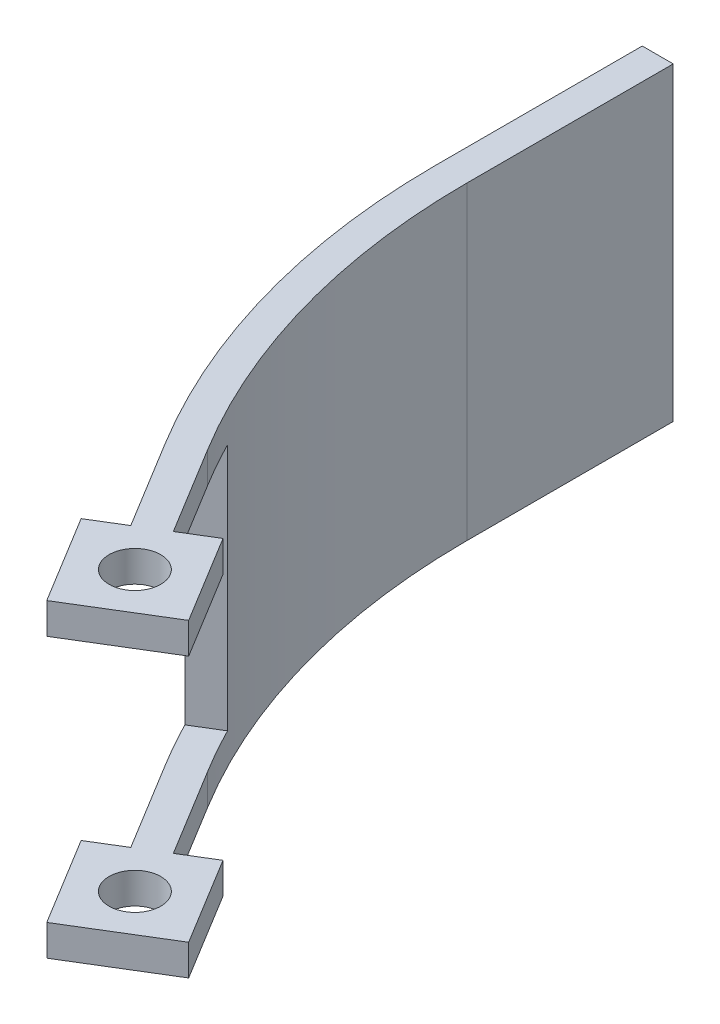
ISO-10303-21;
HEADER;
FILE_DESCRIPTION(('STEP AP214'),'2;1');
FILE_NAME('part.step','',(''),(''),'','','');
FILE_SCHEMA(('AUTOMOTIVE_DESIGN { 1 0 10303 214 1 1 1 1 }'));
ENDSEC;
DATA;
#1=APPLICATION_CONTEXT('core data for automotive mechanical design processes');
#2=APPLICATION_PROTOCOL_DEFINITION('international standard','automotive_design',2000,#1);
#3=PRODUCT_CONTEXT('',#1,'mechanical');
#4=PRODUCT('Part','Part','',(#3));
#5=PRODUCT_RELATED_PRODUCT_CATEGORY('part','',(#4));
#6=PRODUCT_DEFINITION_FORMATION('','',#4);
#7=PRODUCT_DEFINITION_CONTEXT('part definition',#1,'design');
#8=PRODUCT_DEFINITION('design','',#6,#7);
#9=PRODUCT_DEFINITION_SHAPE('','',#8);
#10=(LENGTH_UNIT() NAMED_UNIT(*) SI_UNIT(.MILLI.,.METRE.));
#11=(NAMED_UNIT(*) PLANE_ANGLE_UNIT() SI_UNIT($,.RADIAN.));
#12=(NAMED_UNIT(*) SI_UNIT($,.STERADIAN.) SOLID_ANGLE_UNIT());
#13=UNCERTAINTY_MEASURE_WITH_UNIT(LENGTH_MEASURE(1.E-05),#10,'distance_accuracy_value','');
#14=(GEOMETRIC_REPRESENTATION_CONTEXT(3) GLOBAL_UNCERTAINTY_ASSIGNED_CONTEXT((#13)) GLOBAL_UNIT_ASSIGNED_CONTEXT((#10,
#11,#12)) REPRESENTATION_CONTEXT('',''));
#15=CARTESIAN_POINT('',(0.,0.,0.));
#16=DIRECTION('',(0.,0.,1.));
#17=DIRECTION('',(1.,0.,0.));
#18=AXIS2_PLACEMENT_3D('',#15,#16,#17);
#19=CARTESIAN_POINT('',(10.247310638285,30.,36.463901519755));
#20=DIRECTION('',(0.853609848024501,0.,-0.520912878853641));
#21=DIRECTION('',(-0.520912878853641,0.,-0.853609848024501));
#22=AXIS2_PLACEMENT_3D('',#19,#20,#21);
#23=PLANE('',#22);
#24=DIRECTION('',(0.,-1.,0.));
#25=VECTOR('',#24,1.);
#26=CARTESIAN_POINT('',(15.4564394268214,30.,45.));
#27=LINE('',#26,#25);
#28=CARTESIAN_POINT('',(15.4564394268214,3.,45.));
#29=VERTEX_POINT('',#28);
#30=CARTESIAN_POINT('',(15.4564394268214,0.,45.));
#31=VERTEX_POINT('',#30);
#32=EDGE_CURVE('E224',#29,#31,#27,.T.);
#33=ORIENTED_EDGE('',*,*,#32,.F.);
#34=DIRECTION('',(-0.520912878853641,0.,-0.853609848024501));
#35=VECTOR('',#34,1.);
#36=CARTESIAN_POINT('',(10.247310638285,3.,36.463901519755));
#37=LINE('',#36,#35);
#38=CARTESIAN_POINT('',(10.247310638285,3.,36.463901519755));
#39=VERTEX_POINT('',#38);
#40=EDGE_CURVE('E266',#29,#39,#37,.T.);
#41=ORIENTED_EDGE('',*,*,#40,.T.);
#42=DIRECTION('',(0.,-1.,0.));
#43=VECTOR('',#42,1.);
#44=CARTESIAN_POINT('',(10.247310638285,30.,36.463901519755));
#45=LINE('',#44,#43);
#46=CARTESIAN_POINT('',(10.247310638285,0.,36.463901519755));
#47=VERTEX_POINT('',#46);
#48=EDGE_CURVE('E228',#39,#47,#45,.T.);
#49=ORIENTED_EDGE('',*,*,#48,.T.);
#50=DIRECTION('',(0.520912878853641,0.,0.853609848024501));
#51=VECTOR('',#50,1.);
#52=CARTESIAN_POINT('',(10.247310638285,0.,36.463901519755));
#53=LINE('',#52,#51);
#54=EDGE_CURVE('E168',#47,#31,#53,.T.);
#55=ORIENTED_EDGE('',*,*,#54,.T.);
#56=EDGE_LOOP('',(#33,#41,#49,#55));
#57=FACE_BOUND('',#56,.T.);
#58=ADVANCED_FACE('F31',(#57),#23,.F.);
#59=CARTESIAN_POINT('',(12.4688049587357,30.,46.8231950759877));
#60=DIRECTION('',(0.520912878853642,0.,0.853609848024501));
#61=DIRECTION('',(0.853609848024501,0.,-0.520912878853642));
#62=AXIS2_PLACEMENT_3D('',#59,#60,#61);
#63=PLANE('',#62);
#64=DIRECTION('',(0.,-1.,0.));
#65=VECTOR('',#64,1.);
#66=CARTESIAN_POINT('',(12.4688049587357,30.,46.8231950759877));
#67=LINE('',#66,#65);
#68=CARTESIAN_POINT('',(12.4688049587357,3.,46.8231950759877));
#69=VERTEX_POINT('',#68);
#70=CARTESIAN_POINT('',(12.4688049587357,0.,46.8231950759877));
#71=VERTEX_POINT('',#70);
#72=EDGE_CURVE('E220',#69,#71,#67,.T.);
#73=ORIENTED_EDGE('',*,*,#72,.F.);
#74=DIRECTION('',(0.853609848024501,0.,-0.520912878853642));
#75=VECTOR('',#74,1.);
#76=CARTESIAN_POINT('',(12.4688049587357,3.,46.8231950759877));
#77=LINE('',#76,#75);
#78=EDGE_CURVE('E263',#69,#29,#77,.T.);
#79=ORIENTED_EDGE('',*,*,#78,.T.);
#80=ORIENTED_EDGE('',*,*,#32,.T.);
#81=DIRECTION('',(-0.853609848024501,0.,0.520912878853642));
#82=VECTOR('',#81,1.);
#83=CARTESIAN_POINT('',(12.4688049587357,0.,46.8231950759877));
#84=LINE('',#83,#82);
#85=EDGE_CURVE('E172',#31,#71,#84,.T.);
#86=ORIENTED_EDGE('',*,*,#85,.T.);
#87=EDGE_LOOP('',(#73,#79,#80,#86));
#88=FACE_BOUND('',#87,.T.);
#89=ADVANCED_FACE('F395',(#88),#63,.F.);
#90=CARTESIAN_POINT('',(17.6779337472721,30.,55.3592935562327));
#91=DIRECTION('',(0.853609848024501,0.,-0.520912878853641));
#92=DIRECTION('',(-0.520912878853641,0.,-0.853609848024501));
#93=AXIS2_PLACEMENT_3D('',#90,#91,#92);
#94=PLANE('',#93);
#95=DIRECTION('',(0.,-1.,0.));
#96=VECTOR('',#95,1.);
#97=CARTESIAN_POINT('',(17.6779337472721,30.,55.3592935562327));
#98=LINE('',#97,#96);
#99=CARTESIAN_POINT('',(17.6779337472721,3.,55.3592935562327));
#100=VERTEX_POINT('',#99);
#101=CARTESIAN_POINT('',(17.6779337472721,0.,55.3592935562327));
#102=VERTEX_POINT('',#101);
#103=EDGE_CURVE('E216',#100,#102,#98,.T.);
#104=ORIENTED_EDGE('',*,*,#103,.F.);
#105=DIRECTION('',(0.520912878853641,0.,0.853609848024501));
#106=VECTOR('',#105,1.);
#107=CARTESIAN_POINT('',(17.6779337472721,3.,55.3592935562327));
#108=LINE('',#107,#106);
#109=EDGE_CURVE('E399',#69,#100,#108,.T.);
#110=ORIENTED_EDGE('',*,*,#109,.F.);
#111=ORIENTED_EDGE('',*,*,#72,.T.);
#112=DIRECTION('',(0.520912878853641,0.,0.853609848024501));
#113=VECTOR('',#112,1.);
#114=CARTESIAN_POINT('',(17.6779337472721,0.,55.3592935562327));
#115=LINE('',#114,#113);
#116=EDGE_CURVE('E175',#71,#102,#115,.T.);
#117=ORIENTED_EDGE('',*,*,#116,.T.);
#118=EDGE_LOOP('',(#104,#110,#111,#117));
#119=FACE_BOUND('',#118,.T.);
#120=ADVANCED_FACE('F403',(#119),#94,.F.);
#121=CARTESIAN_POINT('',(26.2140322275171,30.,50.1501647676963));
#122=DIRECTION('',(-0.520912878853641,0.,-0.853609848024501));
#123=DIRECTION('',(-0.853609848024501,0.,0.520912878853641));
#124=AXIS2_PLACEMENT_3D('',#121,#122,#123);
#125=PLANE('',#124);
#126=DIRECTION('',(0.,-1.,0.));
#127=VECTOR('',#126,1.);
#128=CARTESIAN_POINT('',(26.2140322275171,30.,50.1501647676963));
#129=LINE('',#128,#127);
#130=CARTESIAN_POINT('',(26.2140322275171,3.,50.1501647676963));
#131=VERTEX_POINT('',#130);
#132=CARTESIAN_POINT('',(26.2140322275171,0.,50.1501647676963));
#133=VERTEX_POINT('',#132);
#134=EDGE_CURVE('E212',#131,#133,#129,.T.);
#135=ORIENTED_EDGE('',*,*,#134,.F.);
#136=DIRECTION('',(-0.853609848024501,0.,0.520912878853641));
#137=VECTOR('',#136,1.);
#138=CARTESIAN_POINT('',(57.4067493816829,3.,31.11490160895));
#139=LINE('',#138,#137);
#140=EDGE_CURVE('E233',#131,#100,#139,.T.);
#141=ORIENTED_EDGE('',*,*,#140,.T.);
#142=ORIENTED_EDGE('',*,*,#103,.T.);
#143=DIRECTION('',(0.853609848024501,0.,-0.520912878853641));
#144=VECTOR('',#143,1.);
#145=CARTESIAN_POINT('',(26.2140322275171,0.,50.1501647676963));
#146=LINE('',#145,#144);
#147=EDGE_CURVE('E178',#102,#133,#146,.T.);
#148=ORIENTED_EDGE('',*,*,#147,.T.);
#149=EDGE_LOOP('',(#135,#141,#142,#148));
#150=FACE_BOUND('',#149,.T.);
#151=ADVANCED_FACE('F467',(#150),#125,.F.);
#152=CARTESIAN_POINT('',(21.0049034389807,30.,41.6140662874513));
#153=DIRECTION('',(-0.853609848024501,0.,0.520912878853641));
#154=DIRECTION('',(0.520912878853641,0.,0.853609848024501));
#155=AXIS2_PLACEMENT_3D('',#152,#153,#154);
#156=PLANE('',#155);
#157=DIRECTION('',(0.,-1.,0.));
#158=VECTOR('',#157,1.);
#159=CARTESIAN_POINT('',(21.0049034389807,30.,41.6140662874513));
#160=LINE('',#159,#158);
#161=CARTESIAN_POINT('',(21.0049034389807,3.,41.6140662874513));
#162=VERTEX_POINT('',#161);
#163=CARTESIAN_POINT('',(21.0049034389807,0.,41.6140662874513));
#164=VERTEX_POINT('',#163);
#165=EDGE_CURVE('E208',#162,#164,#160,.T.);
#166=ORIENTED_EDGE('',*,*,#165,.F.);
#167=DIRECTION('',(0.520912878853641,0.,0.853609848024502));
#168=VECTOR('',#167,1.);
#169=CARTESIAN_POINT('',(21.0049034389807,2.99999999999999,41.6140662874513));
#170=LINE('',#169,#168);
#171=EDGE_CURVE('E260',#162,#131,#170,.T.);
#172=ORIENTED_EDGE('',*,*,#171,.T.);
#173=ORIENTED_EDGE('',*,*,#134,.T.);
#174=DIRECTION('',(-0.520912878853641,0.,-0.853609848024501));
#175=VECTOR('',#174,1.);
#176=CARTESIAN_POINT('',(21.0049034389807,0.,41.6140662874513));
#177=LINE('',#176,#175);
#178=EDGE_CURVE('E181',#133,#164,#177,.T.);
#179=ORIENTED_EDGE('',*,*,#178,.T.);
#180=EDGE_LOOP('',(#166,#172,#173,#179));
#181=FACE_BOUND('',#180,.T.);
#182=ADVANCED_FACE('F464',(#181),#156,.F.);
#183=CARTESIAN_POINT('',(18.0172689708949,30.,43.4372613634391));
#184=DIRECTION('',(0.52091287885364,0.,0.853609848024502));
#185=DIRECTION('',(0.853609848024502,0.,-0.52091287885364));
#186=AXIS2_PLACEMENT_3D('',#183,#184,#185);
#187=PLANE('',#186);
#188=DIRECTION('',(0.,-1.,0.));
#189=VECTOR('',#188,1.);
#190=CARTESIAN_POINT('',(18.0172689708949,30.,43.4372613634391));
#191=LINE('',#190,#189);
#192=CARTESIAN_POINT('',(18.0172689708949,3.,43.4372613634391));
#193=VERTEX_POINT('',#192);
#194=CARTESIAN_POINT('',(18.0172689708949,0.,43.4372613634391));
#195=VERTEX_POINT('',#194);
#196=EDGE_CURVE('E204',#193,#195,#191,.T.);
#197=ORIENTED_EDGE('',*,*,#196,.F.);
#198=DIRECTION('',(0.853609848024502,0.,-0.52091287885364));
#199=VECTOR('',#198,1.);
#200=CARTESIAN_POINT('',(18.0172689708949,3.,43.4372613634391));
#201=LINE('',#200,#199);
#202=EDGE_CURVE('E257',#193,#162,#201,.T.);
#203=ORIENTED_EDGE('',*,*,#202,.T.);
#204=ORIENTED_EDGE('',*,*,#165,.T.);
#205=DIRECTION('',(-0.853609848024502,0.,0.52091287885364));
#206=VECTOR('',#205,1.);
#207=CARTESIAN_POINT('',(18.0172689708949,0.,43.4372613634391));
#208=LINE('',#207,#206);
#209=EDGE_CURVE('E184',#164,#195,#208,.T.);
#210=ORIENTED_EDGE('',*,*,#209,.T.);
#211=EDGE_LOOP('',(#197,#203,#204,#210));
#212=FACE_BOUND('',#211,.T.);
#213=ADVANCED_FACE('F461',(#212),#187,.F.);
#214=CARTESIAN_POINT('',(12.8081401823585,30.,34.901162883194));
#215=DIRECTION('',(-0.853609848024501,0.,0.520912878853642));
#216=DIRECTION('',(0.520912878853642,0.,0.853609848024501));
#217=AXIS2_PLACEMENT_3D('',#214,#215,#216);
#218=PLANE('',#217);
#219=DIRECTION('',(0.,-1.,0.));
#220=VECTOR('',#219,1.);
#221=CARTESIAN_POINT('',(12.8081401823585,30.,34.901162883194));
#222=LINE('',#221,#220);
#223=CARTESIAN_POINT('',(12.8081401823585,3.,34.901162883194));
#224=VERTEX_POINT('',#223);
#225=CARTESIAN_POINT('',(12.8081401823585,0.,34.901162883194));
#226=VERTEX_POINT('',#225);
#227=EDGE_CURVE('E200',#224,#226,#222,.T.);
#228=ORIENTED_EDGE('',*,*,#227,.F.);
#229=DIRECTION('',(0.520912878853642,0.,0.853609848024501));
#230=VECTOR('',#229,1.);
#231=CARTESIAN_POINT('',(12.8081401823585,3.,34.901162883194));
#232=LINE('',#231,#230);
#233=EDGE_CURVE('E241',#224,#193,#232,.T.);
#234=ORIENTED_EDGE('',*,*,#233,.T.);
#235=ORIENTED_EDGE('',*,*,#196,.T.);
#236=DIRECTION('',(-0.520912878853642,0.,-0.853609848024501));
#237=VECTOR('',#236,1.);
#238=CARTESIAN_POINT('',(12.8081401823585,0.,34.901162883194));
#239=LINE('',#238,#237);
#240=EDGE_CURVE('E187',#195,#226,#239,.T.);
#241=ORIENTED_EDGE('',*,*,#240,.T.);
#242=EDGE_LOOP('',(#228,#234,#235,#241));
#243=FACE_BOUND('',#242,.T.);
#244=ADVANCED_FACE('F458',(#243),#218,.F.);
#245=CARTESIAN_POINT('',(19.3414185931264,30.,48.486679921842));
#246=DIRECTION('',(0.,-1.,0.));
#247=DIRECTION('',(0.,0.,-1.));
#248=AXIS2_PLACEMENT_3D('',#245,#246,#247);
#249=CYLINDRICAL_SURFACE('',#248,2.50000000000001);
#250=CARTESIAN_POINT('',(19.3414185931264,3.,48.486679921842));
#251=DIRECTION('',(0.,-1.,0.));
#252=DIRECTION('',(0.,0.,-1.));
#253=AXIS2_PLACEMENT_3D('',#250,#251,#252);
#254=CIRCLE('',#253,2.50000000000001);
#255=CARTESIAN_POINT('',(19.3414185931264,3.,45.986679921842));
#256=VERTEX_POINT('',#255);
#257=EDGE_CURVE('E234',#256,#256,#254,.T.);
#258=ORIENTED_EDGE('',*,*,#257,.F.);
#259=EDGE_LOOP('',(#258));
#260=FACE_BOUND('',#259,.T.);
#261=CARTESIAN_POINT('',(19.3414185931264,0.,48.486679921842));
#262=DIRECTION('',(0.,1.,0.));
#263=DIRECTION('',(0.,0.,1.));
#264=AXIS2_PLACEMENT_3D('',#261,#262,#263);
#265=CIRCLE('',#264,2.50000000000001);
#266=CARTESIAN_POINT('',(19.3414185931264,0.,50.986679921842));
#267=VERTEX_POINT('',#266);
#268=EDGE_CURVE('E274',#267,#267,#265,.T.);
#269=ORIENTED_EDGE('',*,*,#268,.F.);
#270=EDGE_LOOP('',(#269));
#271=FACE_BOUND('',#270,.T.);
#272=ADVANCED_FACE('F444',(#260,#271),#249,.F.);
#273=CARTESIAN_POINT('',(70.,30.,0.));
#274=DIRECTION('',(0.,1.,0.));
#275=DIRECTION('',(0.,0.,1.));
#276=AXIS2_PLACEMENT_3D('',#273,#274,#275);
#277=PLANE('',#276);
#278=CARTESIAN_POINT('',(70.,30.,0.));
#279=DIRECTION('',(0.,1.,0.));
#280=DIRECTION('',(0.,0.,1.));
#281=AXIS2_PLACEMENT_3D('',#278,#279,#280);
#282=CIRCLE('',#281,70.);
#283=CARTESIAN_POINT('',(0.,30.,0.));
#284=VERTEX_POINT('',#283);
#285=CARTESIAN_POINT('',(10.247310638285,30.,36.463901519755));
#286=VERTEX_POINT('',#285);
#287=EDGE_CURVE('E196',#284,#286,#282,.T.);
#288=ORIENTED_EDGE('',*,*,#287,.T.);
#289=DIRECTION('',(0.520912878853641,0.,0.853609848024501));
#290=VECTOR('',#289,1.);
#291=CARTESIAN_POINT('',(10.247310638285,30.,36.463901519755));
#292=LINE('',#291,#290);
#293=CARTESIAN_POINT('',(15.4564394268214,30.,45.));
#294=VERTEX_POINT('',#293);
#295=EDGE_CURVE('E109',#286,#294,#292,.T.);
#296=ORIENTED_EDGE('',*,*,#295,.T.);
#297=DIRECTION('',(-0.853609848024501,0.,0.520912878853642));
#298=VECTOR('',#297,1.);
#299=CARTESIAN_POINT('',(12.4688049587357,30.,46.8231950759877));
#300=LINE('',#299,#298);
#301=CARTESIAN_POINT('',(12.4688049587357,30.,46.8231950759877));
#302=VERTEX_POINT('',#301);
#303=EDGE_CURVE('E281',#294,#302,#300,.T.);
#304=ORIENTED_EDGE('',*,*,#303,.T.);
#305=DIRECTION('',(0.520912878853641,0.,0.853609848024501));
#306=VECTOR('',#305,1.);
#307=CARTESIAN_POINT('',(17.6779337472721,30.,55.3592935562327));
#308=LINE('',#307,#306);
#309=CARTESIAN_POINT('',(17.6779337472721,30.,55.3592935562327));
#310=VERTEX_POINT('',#309);
#311=EDGE_CURVE('E283',#302,#310,#308,.T.);
#312=ORIENTED_EDGE('',*,*,#311,.T.);
#313=DIRECTION('',(0.853609848024501,0.,-0.520912878853641));
#314=VECTOR('',#313,1.);
#315=CARTESIAN_POINT('',(26.2140322275171,30.,50.1501647676963));
#316=LINE('',#315,#314);
#317=CARTESIAN_POINT('',(26.2140322275171,30.,50.1501647676963));
#318=VERTEX_POINT('',#317);
#319=EDGE_CURVE('E285',#310,#318,#316,.T.);
#320=ORIENTED_EDGE('',*,*,#319,.T.);
#321=DIRECTION('',(-0.520912878853641,0.,-0.853609848024501));
#322=VECTOR('',#321,1.);
#323=CARTESIAN_POINT('',(21.0049034389807,30.,41.6140662874513));
#324=LINE('',#323,#322);
#325=CARTESIAN_POINT('',(21.0049034389807,30.,41.6140662874513));
#326=VERTEX_POINT('',#325);
#327=EDGE_CURVE('E287',#318,#326,#324,.T.);
#328=ORIENTED_EDGE('',*,*,#327,.T.);
#329=DIRECTION('',(-0.853609848024502,0.,0.52091287885364));
#330=VECTOR('',#329,1.);
#331=CARTESIAN_POINT('',(18.0172689708949,30.,43.4372613634391));
#332=LINE('',#331,#330);
#333=CARTESIAN_POINT('',(18.0172689708949,30.,43.4372613634391));
#334=VERTEX_POINT('',#333);
#335=EDGE_CURVE('E289',#326,#334,#332,.T.);
#336=ORIENTED_EDGE('',*,*,#335,.T.);
#337=DIRECTION('',(-0.520912878853642,0.,-0.853609848024501));
#338=VECTOR('',#337,1.);
#339=CARTESIAN_POINT('',(12.8081401823585,30.,34.901162883194));
#340=LINE('',#339,#338);
#341=CARTESIAN_POINT('',(12.8081401823585,30.,34.901162883194));
#342=VERTEX_POINT('',#341);
#343=EDGE_CURVE('E291',#334,#342,#340,.T.);
#344=ORIENTED_EDGE('',*,*,#343,.T.);
#345=CARTESIAN_POINT('',(70.,30.,0.));
#346=DIRECTION('',(0.,-1.,0.));
#347=DIRECTION('',(0.,0.,1.));
#348=AXIS2_PLACEMENT_3D('',#345,#346,#347);
#349=CIRCLE('',#348,67.);
#350=CARTESIAN_POINT('',(3.00000000000001,30.,7.12266617214352E-13));
#351=VERTEX_POINT('',#350);
#352=EDGE_CURVE('E144',#342,#351,#349,.T.);
#353=ORIENTED_EDGE('',*,*,#352,.T.);
#354=DIRECTION('',(0.,0.,-1.));
#355=VECTOR('',#354,1.);
#356=CARTESIAN_POINT('',(3.,30.,-20.));
#357=LINE('',#356,#355);
#358=CARTESIAN_POINT('',(3.,30.,-20.));
#359=VERTEX_POINT('',#358);
#360=EDGE_CURVE('E136',#351,#359,#357,.T.);
#361=ORIENTED_EDGE('',*,*,#360,.T.);
#362=DIRECTION('',(-1.,0.,0.));
#363=VECTOR('',#362,1.);
#364=CARTESIAN_POINT('',(0.,30.,-20.));
#365=LINE('',#364,#363);
#366=CARTESIAN_POINT('',(0.,30.,-20.));
#367=VERTEX_POINT('',#366);
#368=EDGE_CURVE('E141',#359,#367,#365,.T.);
#369=ORIENTED_EDGE('',*,*,#368,.T.);
#370=DIRECTION('',(0.,0.,1.));
#371=VECTOR('',#370,1.);
#372=CARTESIAN_POINT('',(0.,30.,0.));
#373=LINE('',#372,#371);
#374=EDGE_CURVE('E55',#367,#284,#373,.T.);
#375=ORIENTED_EDGE('',*,*,#374,.T.);
#376=EDGE_LOOP('',(#288,#296,#304,#312,#320,#328,#336,#344,#353,#361,#369,#375));
#377=FACE_BOUND('',#376,.T.);
#378=CARTESIAN_POINT('',(19.3414185931264,30.,48.486679921842));
#379=DIRECTION('',(0.,1.,0.));
#380=DIRECTION('',(0.,0.,1.));
#381=AXIS2_PLACEMENT_3D('',#378,#379,#380);
#382=CIRCLE('',#381,2.50000000000001);
#383=CARTESIAN_POINT('',(19.3414185931264,30.,50.986679921842));
#384=VERTEX_POINT('',#383);
#385=EDGE_CURVE('E169',#384,#384,#382,.T.);
#386=ORIENTED_EDGE('',*,*,#385,.F.);
#387=EDGE_LOOP('',(#386));
#388=FACE_BOUND('',#387,.T.);
#389=ADVANCED_FACE('F138',(#377,#388),#277,.T.);
#390=CARTESIAN_POINT('',(70.,0.,0.));
#391=DIRECTION('',(0.,1.,0.));
#392=DIRECTION('',(0.,0.,1.));
#393=AXIS2_PLACEMENT_3D('',#390,#391,#392);
#394=PLANE('',#393);
#395=CARTESIAN_POINT('',(70.,0.,0.));
#396=DIRECTION('',(0.,1.,0.));
#397=DIRECTION('',(0.,0.,1.));
#398=AXIS2_PLACEMENT_3D('',#395,#396,#397);
#399=CIRCLE('',#398,70.);
#400=CARTESIAN_POINT('',(0.,0.,0.));
#401=VERTEX_POINT('',#400);
#402=EDGE_CURVE('E165',#401,#47,#399,.T.);
#403=ORIENTED_EDGE('',*,*,#402,.F.);
#404=DIRECTION('',(0.,0.,1.));
#405=VECTOR('',#404,1.);
#406=CARTESIAN_POINT('',(0.,0.,0.));
#407=LINE('',#406,#405);
#408=CARTESIAN_POINT('',(0.,0.,-20.));
#409=VERTEX_POINT('',#408);
#410=EDGE_CURVE('E100',#409,#401,#407,.T.);
#411=ORIENTED_EDGE('',*,*,#410,.F.);
#412=DIRECTION('',(-1.,0.,0.));
#413=VECTOR('',#412,1.);
#414=CARTESIAN_POINT('',(0.,0.,-20.));
#415=LINE('',#414,#413);
#416=CARTESIAN_POINT('',(3.,0.,-20.));
#417=VERTEX_POINT('',#416);
#418=EDGE_CURVE('E193',#417,#409,#415,.T.);
#419=ORIENTED_EDGE('',*,*,#418,.F.);
#420=DIRECTION('',(0.,0.,-1.));
#421=VECTOR('',#420,1.);
#422=CARTESIAN_POINT('',(3.,0.,-20.));
#423=LINE('',#422,#421);
#424=CARTESIAN_POINT('',(3.00000000000001,0.,7.12266617214352E-13));
#425=VERTEX_POINT('',#424);
#426=EDGE_CURVE('E153',#425,#417,#423,.T.);
#427=ORIENTED_EDGE('',*,*,#426,.F.);
#428=CARTESIAN_POINT('',(70.,0.,0.));
#429=DIRECTION('',(0.,-1.,0.));
#430=DIRECTION('',(0.,0.,1.));
#431=AXIS2_PLACEMENT_3D('',#428,#429,#430);
#432=CIRCLE('',#431,67.);
#433=EDGE_CURVE('E190',#226,#425,#432,.T.);
#434=ORIENTED_EDGE('',*,*,#433,.F.);
#435=ORIENTED_EDGE('',*,*,#240,.F.);
#436=ORIENTED_EDGE('',*,*,#209,.F.);
#437=ORIENTED_EDGE('',*,*,#178,.F.);
#438=ORIENTED_EDGE('',*,*,#147,.F.);
#439=ORIENTED_EDGE('',*,*,#116,.F.);
#440=ORIENTED_EDGE('',*,*,#85,.F.);
#441=ORIENTED_EDGE('',*,*,#54,.F.);
#442=EDGE_LOOP('',(#403,#411,#419,#427,#434,#435,#436,#437,#438,#439,#440,#441));
#443=FACE_BOUND('',#442,.T.);
#444=ORIENTED_EDGE('',*,*,#268,.T.);
#445=EDGE_LOOP('',(#444));
#446=FACE_BOUND('',#445,.T.);
#447=ADVANCED_FACE('F308',(#443,#446),#394,.F.);
#448=CARTESIAN_POINT('',(70.,30.,0.));
#449=DIRECTION('',(0.,-1.,0.));
#450=DIRECTION('',(0.,0.,-1.));
#451=AXIS2_PLACEMENT_3D('',#448,#449,#450);
#452=CYLINDRICAL_SURFACE('',#451,70.);
#453=ORIENTED_EDGE('',*,*,#48,.F.);
#454=CARTESIAN_POINT('',(70.,3.,0.));
#455=DIRECTION('',(0.,-1.,0.));
#456=DIRECTION('',(0.,0.,-1.));
#457=AXIS2_PLACEMENT_3D('',#454,#455,#456);
#458=CIRCLE('',#457,70.);
#459=CARTESIAN_POINT('',(7.79537149803556,3.,32.1027131708925));
#460=VERTEX_POINT('',#459);
#461=EDGE_CURVE('E269',#39,#460,#458,.T.);
#462=ORIENTED_EDGE('',*,*,#461,.T.);
#463=DIRECTION('',(0.,-1.,0.));
#464=VECTOR('',#463,1.);
#465=CARTESIAN_POINT('',(7.79537149803556,30.,32.1027131708925));
#466=LINE('',#465,#464);
#467=CARTESIAN_POINT('',(7.79537149803556,27.,32.1027131708925));
#468=VERTEX_POINT('',#467);
#469=EDGE_CURVE('E272',#460,#468,#466,.F.);
#470=ORIENTED_EDGE('',*,*,#469,.T.);
#471=CARTESIAN_POINT('',(70.,27.,0.));
#472=DIRECTION('',(0.,1.,0.));
#473=DIRECTION('',(0.,0.,1.));
#474=AXIS2_PLACEMENT_3D('',#471,#472,#473);
#475=CIRCLE('',#474,70.);
#476=CARTESIAN_POINT('',(10.247310638285,27.,36.463901519755));
#477=VERTEX_POINT('',#476);
#478=EDGE_CURVE('E237',#468,#477,#475,.T.);
#479=ORIENTED_EDGE('',*,*,#478,.T.);
#480=EDGE_CURVE('E39',#286,#477,#45,.T.);
#481=ORIENTED_EDGE('',*,*,#480,.F.);
#482=ORIENTED_EDGE('',*,*,#287,.F.);
#483=DIRECTION('',(0.,-1.,0.));
#484=VECTOR('',#483,1.);
#485=CARTESIAN_POINT('',(0.,30.,0.));
#486=LINE('',#485,#484);
#487=EDGE_CURVE('E161',#284,#401,#486,.T.);
#488=ORIENTED_EDGE('',*,*,#487,.T.);
#489=ORIENTED_EDGE('',*,*,#402,.T.);
#490=EDGE_LOOP('',(#453,#462,#470,#479,#481,#482,#488,#489));
#491=FACE_BOUND('',#490,.T.);
#492=ADVANCED_FACE('F33',(#491),#452,.T.);
#493=ORIENTED_EDGE('',*,*,#480,.T.);
#494=DIRECTION('',(0.520912878853641,0.,0.853609848024501));
#495=VECTOR('',#494,1.);
#496=CARTESIAN_POINT('',(10.247310638285,27.,36.463901519755));
#497=LINE('',#496,#495);
#498=CARTESIAN_POINT('',(15.4564394268214,27.,45.));
#499=VERTEX_POINT('',#498);
#500=EDGE_CURVE('E244',#477,#499,#497,.T.);
#501=ORIENTED_EDGE('',*,*,#500,.T.);
#502=EDGE_CURVE('E225',#294,#499,#27,.T.);
#503=ORIENTED_EDGE('',*,*,#502,.F.);
#504=ORIENTED_EDGE('',*,*,#295,.F.);
#505=EDGE_LOOP('',(#493,#501,#503,#504));
#506=FACE_BOUND('',#505,.T.);
#507=ADVANCED_FACE('F316',(#506),#23,.F.);
#508=ORIENTED_EDGE('',*,*,#502,.T.);
#509=DIRECTION('',(-0.853609848024501,0.,0.520912878853642));
#510=VECTOR('',#509,1.);
#511=CARTESIAN_POINT('',(12.4688049587357,27.,46.8231950759877));
#512=LINE('',#511,#510);
#513=CARTESIAN_POINT('',(12.4688049587357,27.,46.8231950759877));
#514=VERTEX_POINT('',#513);
#515=EDGE_CURVE('E251',#499,#514,#512,.T.);
#516=ORIENTED_EDGE('',*,*,#515,.T.);
#517=EDGE_CURVE('E221',#302,#514,#67,.T.);
#518=ORIENTED_EDGE('',*,*,#517,.F.);
#519=ORIENTED_EDGE('',*,*,#303,.F.);
#520=EDGE_LOOP('',(#508,#516,#518,#519));
#521=FACE_BOUND('',#520,.T.);
#522=ADVANCED_FACE('F321',(#521),#63,.F.);
#523=ORIENTED_EDGE('',*,*,#517,.T.);
#524=DIRECTION('',(-0.520912878853641,0.,-0.853609848024501));
#525=VECTOR('',#524,1.);
#526=CARTESIAN_POINT('',(17.6779337472721,27.,55.3592935562327));
#527=LINE('',#526,#525);
#528=CARTESIAN_POINT('',(17.6779337472721,27.,55.3592935562327));
#529=VERTEX_POINT('',#528);
#530=EDGE_CURVE('E404',#529,#514,#527,.T.);
#531=ORIENTED_EDGE('',*,*,#530,.F.);
#532=EDGE_CURVE('E217',#310,#529,#98,.T.);
#533=ORIENTED_EDGE('',*,*,#532,.F.);
#534=ORIENTED_EDGE('',*,*,#311,.F.);
#535=EDGE_LOOP('',(#523,#531,#533,#534));
#536=FACE_BOUND('',#535,.T.);
#537=ADVANCED_FACE('F328',(#536),#94,.F.);
#538=ORIENTED_EDGE('',*,*,#532,.T.);
#539=DIRECTION('',(-0.853609848024501,0.,0.520912878853641));
#540=VECTOR('',#539,1.);
#541=CARTESIAN_POINT('',(57.4067493816829,27.,31.11490160895));
#542=LINE('',#541,#540);
#543=CARTESIAN_POINT('',(26.2140322275171,27.,50.1501647676963));
#544=VERTEX_POINT('',#543);
#545=EDGE_CURVE('E338',#544,#529,#542,.T.);
#546=ORIENTED_EDGE('',*,*,#545,.F.);
#547=EDGE_CURVE('E213',#318,#544,#129,.T.);
#548=ORIENTED_EDGE('',*,*,#547,.F.);
#549=ORIENTED_EDGE('',*,*,#319,.F.);
#550=EDGE_LOOP('',(#538,#546,#548,#549));
#551=FACE_BOUND('',#550,.T.);
#552=ADVANCED_FACE('F335',(#551),#125,.F.);
#553=ORIENTED_EDGE('',*,*,#547,.T.);
#554=DIRECTION('',(-0.520912878853641,0.,-0.853609848024502));
#555=VECTOR('',#554,1.);
#556=CARTESIAN_POINT('',(21.0049034389807,27.,41.6140662874513));
#557=LINE('',#556,#555);
#558=CARTESIAN_POINT('',(21.0049034389807,27.,41.6140662874513));
#559=VERTEX_POINT('',#558);
#560=EDGE_CURVE('E344',#544,#559,#557,.T.);
#561=ORIENTED_EDGE('',*,*,#560,.T.);
#562=EDGE_CURVE('E209',#326,#559,#160,.T.);
#563=ORIENTED_EDGE('',*,*,#562,.F.);
#564=ORIENTED_EDGE('',*,*,#327,.F.);
#565=EDGE_LOOP('',(#553,#561,#563,#564));
#566=FACE_BOUND('',#565,.T.);
#567=ADVANCED_FACE('F341',(#566),#156,.F.);
#568=ORIENTED_EDGE('',*,*,#562,.T.);
#569=DIRECTION('',(-0.853609848024502,0.,0.52091287885364));
#570=VECTOR('',#569,1.);
#571=CARTESIAN_POINT('',(18.0172689708949,27.,43.4372613634391));
#572=LINE('',#571,#570);
#573=CARTESIAN_POINT('',(18.0172689708949,27.,43.4372613634391));
#574=VERTEX_POINT('',#573);
#575=EDGE_CURVE('E350',#559,#574,#572,.T.);
#576=ORIENTED_EDGE('',*,*,#575,.T.);
#577=EDGE_CURVE('E205',#334,#574,#191,.T.);
#578=ORIENTED_EDGE('',*,*,#577,.F.);
#579=ORIENTED_EDGE('',*,*,#335,.F.);
#580=EDGE_LOOP('',(#568,#576,#578,#579));
#581=FACE_BOUND('',#580,.T.);
#582=ADVANCED_FACE('F347',(#581),#187,.F.);
#583=ORIENTED_EDGE('',*,*,#577,.T.);
#584=DIRECTION('',(-0.520912878853642,0.,-0.853609848024501));
#585=VECTOR('',#584,1.);
#586=CARTESIAN_POINT('',(12.8081401823585,27.,34.901162883194));
#587=LINE('',#586,#585);
#588=CARTESIAN_POINT('',(12.8081401823585,27.,34.901162883194));
#589=VERTEX_POINT('',#588);
#590=EDGE_CURVE('E301',#574,#589,#587,.T.);
#591=ORIENTED_EDGE('',*,*,#590,.T.);
#592=EDGE_CURVE('E201',#342,#589,#222,.T.);
#593=ORIENTED_EDGE('',*,*,#592,.F.);
#594=ORIENTED_EDGE('',*,*,#343,.F.);
#595=EDGE_LOOP('',(#583,#591,#593,#594));
#596=FACE_BOUND('',#595,.T.);
#597=ADVANCED_FACE('F298',(#596),#218,.F.);
#598=CARTESIAN_POINT('',(70.,30.,0.));
#599=DIRECTION('',(0.,-1.,0.));
#600=DIRECTION('',(0.,0.,-1.));
#601=AXIS2_PLACEMENT_3D('',#598,#599,#600);
#602=CYLINDRICAL_SURFACE('',#601,67.);
#603=DIRECTION('',(0.,-1.,0.));
#604=VECTOR('',#603,1.);
#605=CARTESIAN_POINT('',(10.363053706633,30.,30.5357927161235));
#606=LINE('',#605,#604);
#607=CARTESIAN_POINT('',(10.363053706633,27.,30.5357927161235));
#608=VERTEX_POINT('',#607);
#609=CARTESIAN_POINT('',(10.363053706633,3.,30.5357927161235));
#610=VERTEX_POINT('',#609);
#611=EDGE_CURVE('E11',#608,#610,#606,.T.);
#612=ORIENTED_EDGE('',*,*,#611,.T.);
#613=CARTESIAN_POINT('',(70.,3.,0.));
#614=DIRECTION('',(0.,-1.,0.));
#615=DIRECTION('',(0.,0.,-1.));
#616=AXIS2_PLACEMENT_3D('',#613,#614,#615);
#617=CIRCLE('',#616,67.);
#618=EDGE_CURVE('E236',#610,#224,#617,.F.);
#619=ORIENTED_EDGE('',*,*,#618,.T.);
#620=ORIENTED_EDGE('',*,*,#227,.T.);
#621=ORIENTED_EDGE('',*,*,#433,.T.);
#622=DIRECTION('',(0.,-1.,0.));
#623=VECTOR('',#622,1.);
#624=CARTESIAN_POINT('',(3.00000000000001,30.,7.12266617214352E-13));
#625=LINE('',#624,#623);
#626=EDGE_CURVE('E156',#351,#425,#625,.T.);
#627=ORIENTED_EDGE('',*,*,#626,.F.);
#628=ORIENTED_EDGE('',*,*,#352,.F.);
#629=ORIENTED_EDGE('',*,*,#592,.T.);
#630=CARTESIAN_POINT('',(70.,27.,0.));
#631=DIRECTION('',(0.,1.,0.));
#632=DIRECTION('',(0.,0.,1.));
#633=AXIS2_PLACEMENT_3D('',#630,#631,#632);
#634=CIRCLE('',#633,67.);
#635=EDGE_CURVE('E232',#589,#608,#634,.F.);
#636=ORIENTED_EDGE('',*,*,#635,.T.);
#637=EDGE_LOOP('',(#612,#619,#620,#621,#627,#628,#629,#636));
#638=FACE_BOUND('',#637,.T.);
#639=ADVANCED_FACE('F304',(#638),#602,.F.);
#640=CARTESIAN_POINT('',(3.,30.,-20.));
#641=DIRECTION('',(-1.,0.,0.));
#642=DIRECTION('',(0.,0.,1.));
#643=AXIS2_PLACEMENT_3D('',#640,#641,#642);
#644=PLANE('',#643);
#645=ORIENTED_EDGE('',*,*,#426,.T.);
#646=DIRECTION('',(0.,-1.,0.));
#647=VECTOR('',#646,1.);
#648=CARTESIAN_POINT('',(3.,30.,-20.));
#649=LINE('',#648,#647);
#650=EDGE_CURVE('E150',#359,#417,#649,.T.);
#651=ORIENTED_EDGE('',*,*,#650,.F.);
#652=ORIENTED_EDGE('',*,*,#360,.F.);
#653=ORIENTED_EDGE('',*,*,#626,.T.);
#654=EDGE_LOOP('',(#645,#651,#652,#653));
#655=FACE_BOUND('',#654,.T.);
#656=ADVANCED_FACE('F151',(#655),#644,.F.);
#657=CARTESIAN_POINT('',(0.,30.,-20.));
#658=DIRECTION('',(0.,0.,1.));
#659=DIRECTION('',(1.,0.,0.));
#660=AXIS2_PLACEMENT_3D('',#657,#658,#659);
#661=PLANE('',#660);
#662=ORIENTED_EDGE('',*,*,#418,.T.);
#663=DIRECTION('',(0.,-1.,0.));
#664=VECTOR('',#663,1.);
#665=CARTESIAN_POINT('',(0.,30.,-20.));
#666=LINE('',#665,#664);
#667=EDGE_CURVE('E157',#367,#409,#666,.T.);
#668=ORIENTED_EDGE('',*,*,#667,.F.);
#669=ORIENTED_EDGE('',*,*,#368,.F.);
#670=ORIENTED_EDGE('',*,*,#650,.T.);
#671=EDGE_LOOP('',(#662,#668,#669,#670));
#672=FACE_BOUND('',#671,.T.);
#673=ADVANCED_FACE('F159',(#672),#661,.F.);
#674=CARTESIAN_POINT('',(0.,30.,0.));
#675=DIRECTION('',(1.,0.,0.));
#676=DIRECTION('',(0.,0.,-1.));
#677=AXIS2_PLACEMENT_3D('',#674,#675,#676);
#678=PLANE('',#677);
#679=ORIENTED_EDGE('',*,*,#410,.T.);
#680=ORIENTED_EDGE('',*,*,#487,.F.);
#681=ORIENTED_EDGE('',*,*,#374,.F.);
#682=ORIENTED_EDGE('',*,*,#667,.T.);
#683=EDGE_LOOP('',(#679,#680,#681,#682));
#684=FACE_BOUND('',#683,.T.);
#685=ADVANCED_FACE('F311',(#684),#678,.F.);
#686=CARTESIAN_POINT('',(19.3414185931264,27.,48.486679921842));
#687=DIRECTION('',(0.,1.,0.));
#688=DIRECTION('',(0.,0.,1.));
#689=AXIS2_PLACEMENT_3D('',#686,#687,#688);
#690=CIRCLE('',#689,2.50000000000001);
#691=CARTESIAN_POINT('',(19.3414185931264,27.,50.986679921842));
#692=VERTEX_POINT('',#691);
#693=EDGE_CURVE('E230',#692,#692,#690,.T.);
#694=ORIENTED_EDGE('',*,*,#693,.F.);
#695=EDGE_LOOP('',(#694));
#696=FACE_BOUND('',#695,.T.);
#697=ORIENTED_EDGE('',*,*,#385,.T.);
#698=EDGE_LOOP('',(#697));
#699=FACE_BOUND('',#698,.T.);
#700=ADVANCED_FACE('F449',(#696,#699),#249,.F.);
#701=CARTESIAN_POINT('',(44.3839274103419,27.,9.77465540833743));
#702=DIRECTION('',(-0.520912878853641,0.,-0.853609848024501));
#703=DIRECTION('',(-0.853609848024501,0.,0.520912878853641));
#704=AXIS2_PLACEMENT_3D('',#701,#702,#703);
#705=PLANE('',#704);
#706=DIRECTION('',(-0.853609848024501,0.,0.520912878853641));
#707=VECTOR('',#706,1.);
#708=CARTESIAN_POINT('',(44.3839274103419,3.,9.77465540833743));
#709=LINE('',#708,#707);
#710=EDGE_CURVE('E386',#610,#460,#709,.T.);
#711=ORIENTED_EDGE('',*,*,#710,.F.);
#712=ORIENTED_EDGE('',*,*,#611,.F.);
#713=DIRECTION('',(-0.853609848024501,0.,0.520912878853641));
#714=VECTOR('',#713,1.);
#715=CARTESIAN_POINT('',(44.3839274103419,27.,9.77465540833743));
#716=LINE('',#715,#714);
#717=EDGE_CURVE('E46',#608,#468,#716,.T.);
#718=ORIENTED_EDGE('',*,*,#717,.T.);
#719=ORIENTED_EDGE('',*,*,#469,.F.);
#720=EDGE_LOOP('',(#711,#712,#718,#719));
#721=FACE_BOUND('',#720,.T.);
#722=ADVANCED_FACE('F423',(#721),#705,.F.);
#723=CARTESIAN_POINT('',(57.4067493816829,3.,31.11490160895));
#724=DIRECTION('',(0.,-1.,0.));
#725=DIRECTION('',(0.,0.,-1.));
#726=AXIS2_PLACEMENT_3D('',#723,#724,#725);
#727=PLANE('',#726);
#728=ORIENTED_EDGE('',*,*,#257,.T.);
#729=EDGE_LOOP('',(#728));
#730=FACE_BOUND('',#729,.T.);
#731=ORIENTED_EDGE('',*,*,#40,.F.);
#732=ORIENTED_EDGE('',*,*,#78,.F.);
#733=ORIENTED_EDGE('',*,*,#109,.T.);
#734=ORIENTED_EDGE('',*,*,#140,.F.);
#735=ORIENTED_EDGE('',*,*,#171,.F.);
#736=ORIENTED_EDGE('',*,*,#202,.F.);
#737=ORIENTED_EDGE('',*,*,#233,.F.);
#738=ORIENTED_EDGE('',*,*,#618,.F.);
#739=ORIENTED_EDGE('',*,*,#710,.T.);
#740=ORIENTED_EDGE('',*,*,#461,.F.);
#741=EDGE_LOOP('',(#731,#732,#733,#734,#735,#736,#737,#738,#739,#740));
#742=FACE_BOUND('',#741,.T.);
#743=ADVANCED_FACE('F384',(#730,#742),#727,.F.);
#744=CARTESIAN_POINT('',(57.4067493816829,27.,31.11490160895));
#745=DIRECTION('',(0.,1.,0.));
#746=DIRECTION('',(0.,0.,1.));
#747=AXIS2_PLACEMENT_3D('',#744,#745,#746);
#748=PLANE('',#747);
#749=ORIENTED_EDGE('',*,*,#693,.T.);
#750=EDGE_LOOP('',(#749));
#751=FACE_BOUND('',#750,.T.);
#752=ORIENTED_EDGE('',*,*,#717,.F.);
#753=ORIENTED_EDGE('',*,*,#635,.F.);
#754=ORIENTED_EDGE('',*,*,#590,.F.);
#755=ORIENTED_EDGE('',*,*,#575,.F.);
#756=ORIENTED_EDGE('',*,*,#560,.F.);
#757=ORIENTED_EDGE('',*,*,#545,.T.);
#758=ORIENTED_EDGE('',*,*,#530,.T.);
#759=ORIENTED_EDGE('',*,*,#515,.F.);
#760=ORIENTED_EDGE('',*,*,#500,.F.);
#761=ORIENTED_EDGE('',*,*,#478,.F.);
#762=EDGE_LOOP('',(#752,#753,#754,#755,#756,#757,#758,#759,#760,#761));
#763=FACE_BOUND('',#762,.T.);
#764=ADVANCED_FACE('F416',(#751,#763),#748,.F.);
#765=CLOSED_SHELL('',(#58,#89,#120,#151,#182,#213,#244,#272,#389,#447,#492,#507,#522,#537,#552,
#567,#582,#597,#639,#656,#673,#685,#700,#722,#743,#764));
#766=MANIFOLD_SOLID_BREP('B2',#765);
#767=ADVANCED_BREP_SHAPE_REPRESENTATION('',(#18,#766),#14);
#768=SHAPE_DEFINITION_REPRESENTATION(#9,#767);
ENDSEC;
END-ISO-10303-21;
